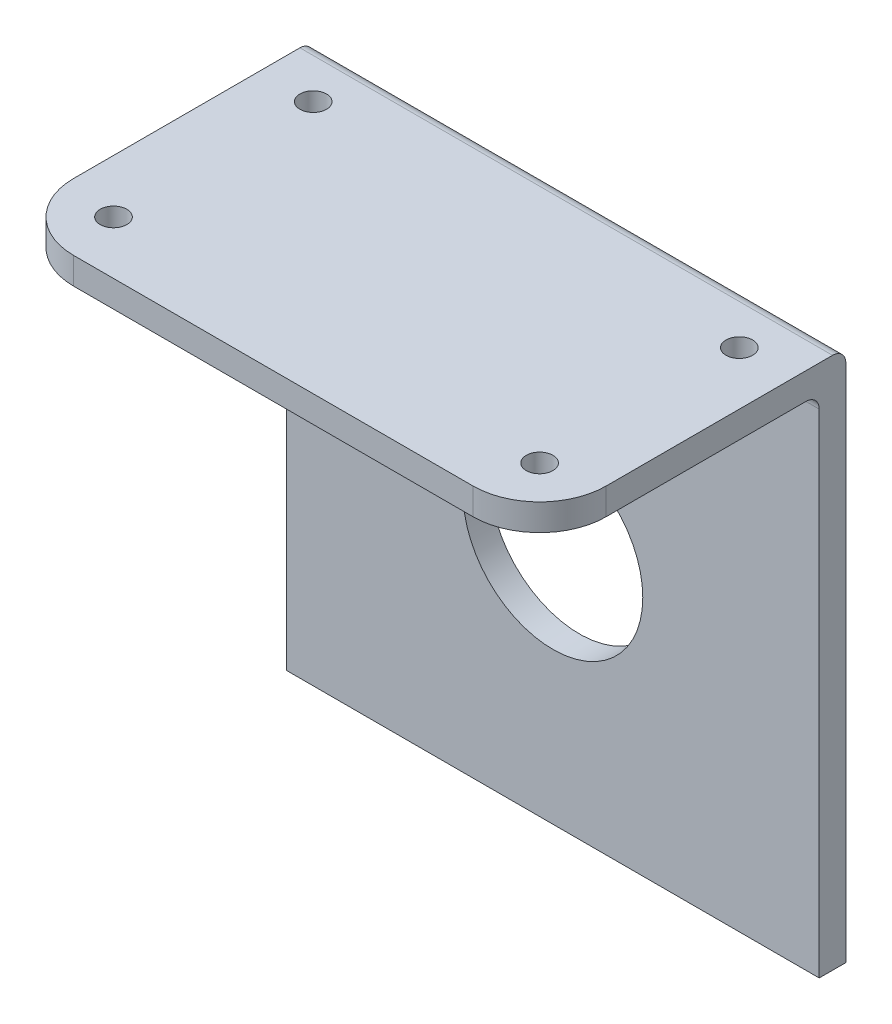
ISO-10303-21;
HEADER;
FILE_DESCRIPTION(('STEP AP214'),'2;1');
FILE_NAME('part.step','',(''),(''),'','','');
FILE_SCHEMA(('AUTOMOTIVE_DESIGN { 1 0 10303 214 1 1 1 1 }'));
ENDSEC;
DATA;
#1=APPLICATION_CONTEXT('core data for automotive mechanical design processes');
#2=APPLICATION_PROTOCOL_DEFINITION('international standard','automotive_design',2000,#1);
#3=PRODUCT_CONTEXT('',#1,'mechanical');
#4=PRODUCT('Part','Part','',(#3));
#5=PRODUCT_RELATED_PRODUCT_CATEGORY('part','',(#4));
#6=PRODUCT_DEFINITION_FORMATION('','',#4);
#7=PRODUCT_DEFINITION_CONTEXT('part definition',#1,'design');
#8=PRODUCT_DEFINITION('design','',#6,#7);
#9=PRODUCT_DEFINITION_SHAPE('','',#8);
#10=(LENGTH_UNIT() NAMED_UNIT(*) SI_UNIT(.MILLI.,.METRE.));
#11=(NAMED_UNIT(*) PLANE_ANGLE_UNIT() SI_UNIT($,.RADIAN.));
#12=(NAMED_UNIT(*) SI_UNIT($,.STERADIAN.) SOLID_ANGLE_UNIT());
#13=UNCERTAINTY_MEASURE_WITH_UNIT(LENGTH_MEASURE(1.E-05),#10,'distance_accuracy_value','');
#14=(GEOMETRIC_REPRESENTATION_CONTEXT(3) GLOBAL_UNCERTAINTY_ASSIGNED_CONTEXT((#13)) GLOBAL_UNIT_ASSIGNED_CONTEXT((#10,
#11,#12)) REPRESENTATION_CONTEXT('',''));
#15=CARTESIAN_POINT('',(0.,0.,0.));
#16=DIRECTION('',(0.,0.,1.));
#17=DIRECTION('',(1.,0.,0.));
#18=AXIS2_PLACEMENT_3D('',#15,#16,#17);
#19=CARTESIAN_POINT('',(0.,0.,2.));
#20=DIRECTION('',(0.,0.,1.));
#21=DIRECTION('',(1.,0.,0.));
#22=AXIS2_PLACEMENT_3D('',#19,#20,#21);
#23=PLANE('',#22);
#24=CARTESIAN_POINT('',(0.,-1.87885429106523,2.));
#25=DIRECTION('',(0.,0.,1.));
#26=DIRECTION('',(1.,0.,0.));
#27=AXIS2_PLACEMENT_3D('',#24,#25,#26);
#28=CIRCLE('',#27,6.75);
#29=CARTESIAN_POINT('',(6.75,-1.87885429106523,2.));
#30=VERTEX_POINT('',#29);
#31=EDGE_CURVE('E153',#30,#30,#28,.T.);
#32=ORIENTED_EDGE('',*,*,#31,.F.);
#33=EDGE_LOOP('',(#32));
#34=FACE_BOUND('',#33,.T.);
#35=DIRECTION('',(0.,1.,0.));
#36=VECTOR('',#35,1.);
#37=CARTESIAN_POINT('',(20.,20.,2.));
#38=LINE('',#37,#36);
#39=CARTESIAN_POINT('',(20.,-20.,2.));
#40=VERTEX_POINT('',#39);
#41=CARTESIAN_POINT('',(20.,17.,2.));
#42=VERTEX_POINT('',#41);
#43=EDGE_CURVE('E131',#40,#42,#38,.T.);
#44=ORIENTED_EDGE('',*,*,#43,.T.);
#45=DIRECTION('',(-1.,0.,0.));
#46=VECTOR('',#45,1.);
#47=CARTESIAN_POINT('',(0.,17.,2.));
#48=LINE('',#47,#46);
#49=CARTESIAN_POINT('',(-20.,17.,2.));
#50=VERTEX_POINT('',#49);
#51=EDGE_CURVE('E128',#42,#50,#48,.T.);
#52=ORIENTED_EDGE('',*,*,#51,.T.);
#53=DIRECTION('',(0.,-1.,0.));
#54=VECTOR('',#53,1.);
#55=CARTESIAN_POINT('',(-20.,20.,2.));
#56=LINE('',#55,#54);
#57=CARTESIAN_POINT('',(-20.,-20.,2.));
#58=VERTEX_POINT('',#57);
#59=EDGE_CURVE('E121',#50,#58,#56,.T.);
#60=ORIENTED_EDGE('',*,*,#59,.T.);
#61=DIRECTION('',(1.,0.,0.));
#62=VECTOR('',#61,1.);
#63=CARTESIAN_POINT('',(-20.,-20.,2.));
#64=LINE('',#63,#62);
#65=EDGE_CURVE('E125',#58,#40,#64,.T.);
#66=ORIENTED_EDGE('',*,*,#65,.T.);
#67=EDGE_LOOP('',(#44,#52,#60,#66));
#68=FACE_BOUND('',#67,.T.);
#69=ADVANCED_FACE('F38',(#34,#68),#23,.T.);
#70=CARTESIAN_POINT('',(0.,0.,0.));
#71=DIRECTION('',(0.,0.,1.));
#72=DIRECTION('',(1.,0.,0.));
#73=AXIS2_PLACEMENT_3D('',#70,#71,#72);
#74=PLANE('',#73);
#75=DIRECTION('',(0.,-1.,0.));
#76=VECTOR('',#75,1.);
#77=CARTESIAN_POINT('',(-20.,20.,0.));
#78=LINE('',#77,#76);
#79=CARTESIAN_POINT('',(-20.,19.,0.));
#80=VERTEX_POINT('',#79);
#81=CARTESIAN_POINT('',(-20.,-20.,0.));
#82=VERTEX_POINT('',#81);
#83=EDGE_CURVE('E137',#80,#82,#78,.T.);
#84=ORIENTED_EDGE('',*,*,#83,.F.);
#85=DIRECTION('',(-1.,0.,0.));
#86=VECTOR('',#85,1.);
#87=CARTESIAN_POINT('',(0.,19.,0.));
#88=LINE('',#87,#86);
#89=CARTESIAN_POINT('',(20.,19.,0.));
#90=VERTEX_POINT('',#89);
#91=EDGE_CURVE('E165',#80,#90,#88,.F.);
#92=ORIENTED_EDGE('',*,*,#91,.T.);
#93=DIRECTION('',(0.,1.,0.));
#94=VECTOR('',#93,1.);
#95=CARTESIAN_POINT('',(20.,20.,0.));
#96=LINE('',#95,#94);
#97=CARTESIAN_POINT('',(20.,-20.,0.));
#98=VERTEX_POINT('',#97);
#99=EDGE_CURVE('E150',#98,#90,#96,.T.);
#100=ORIENTED_EDGE('',*,*,#99,.F.);
#101=DIRECTION('',(1.,0.,0.));
#102=VECTOR('',#101,1.);
#103=CARTESIAN_POINT('',(-20.,-20.,0.));
#104=LINE('',#103,#102);
#105=EDGE_CURVE('E155',#82,#98,#104,.T.);
#106=ORIENTED_EDGE('',*,*,#105,.F.);
#107=EDGE_LOOP('',(#84,#92,#100,#106));
#108=FACE_BOUND('',#107,.T.);
#109=CARTESIAN_POINT('',(0.,-1.87885429106523,0.));
#110=DIRECTION('',(0.,0.,1.));
#111=DIRECTION('',(1.,0.,0.));
#112=AXIS2_PLACEMENT_3D('',#109,#110,#111);
#113=CIRCLE('',#112,6.75);
#114=CARTESIAN_POINT('',(6.75,-1.87885429106523,0.));
#115=VERTEX_POINT('',#114);
#116=EDGE_CURVE('E225',#115,#115,#113,.T.);
#117=ORIENTED_EDGE('',*,*,#116,.T.);
#118=EDGE_LOOP('',(#117));
#119=FACE_BOUND('',#118,.T.);
#120=ADVANCED_FACE('F286',(#108,#119),#74,.F.);
#121=CARTESIAN_POINT('',(20.,20.,2.));
#122=DIRECTION('',(-1.,0.,0.));
#123=DIRECTION('',(0.,-1.,0.));
#124=AXIS2_PLACEMENT_3D('',#121,#122,#123);
#125=PLANE('',#124);
#126=DIRECTION('',(0.,0.,-1.));
#127=VECTOR('',#126,1.);
#128=CARTESIAN_POINT('',(20.,20.,2.));
#129=LINE('',#128,#127);
#130=CARTESIAN_POINT('',(20.,20.,18.));
#131=VERTEX_POINT('',#130);
#132=CARTESIAN_POINT('',(20.,20.,1.));
#133=VERTEX_POINT('',#132);
#134=EDGE_CURVE('E158',#131,#133,#129,.T.);
#135=ORIENTED_EDGE('',*,*,#134,.F.);
#136=DIRECTION('',(0.,1.,0.));
#137=VECTOR('',#136,1.);
#138=CARTESIAN_POINT('',(20.,18.,18.));
#139=LINE('',#138,#137);
#140=CARTESIAN_POINT('',(20.,18.,18.));
#141=VERTEX_POINT('',#140);
#142=EDGE_CURVE('E61',#131,#141,#139,.F.);
#143=ORIENTED_EDGE('',*,*,#142,.T.);
#144=DIRECTION('',(0.,0.,-1.));
#145=VECTOR('',#144,1.);
#146=CARTESIAN_POINT('',(20.,18.,23.));
#147=LINE('',#146,#145);
#148=CARTESIAN_POINT('',(20.,18.,3.));
#149=VERTEX_POINT('',#148);
#150=EDGE_CURVE('E197',#141,#149,#147,.T.);
#151=ORIENTED_EDGE('',*,*,#150,.T.);
#152=CARTESIAN_POINT('',(20.,17.,3.));
#153=DIRECTION('',(-1.,0.,0.));
#154=DIRECTION('',(0.,-1.,0.));
#155=AXIS2_PLACEMENT_3D('',#152,#153,#154);
#156=CIRCLE('',#155,1.);
#157=EDGE_CURVE('E180',#149,#42,#156,.T.);
#158=ORIENTED_EDGE('',*,*,#157,.T.);
#159=ORIENTED_EDGE('',*,*,#43,.F.);
#160=DIRECTION('',(0.,0.,-1.));
#161=VECTOR('',#160,1.);
#162=CARTESIAN_POINT('',(20.,-20.,2.));
#163=LINE('',#162,#161);
#164=EDGE_CURVE('E141',#40,#98,#163,.T.);
#165=ORIENTED_EDGE('',*,*,#164,.T.);
#166=ORIENTED_EDGE('',*,*,#99,.T.);
#167=CARTESIAN_POINT('',(20.,19.,1.));
#168=DIRECTION('',(-1.,0.,0.));
#169=DIRECTION('',(0.,-1.,0.));
#170=AXIS2_PLACEMENT_3D('',#167,#168,#169);
#171=CIRCLE('',#170,1.);
#172=EDGE_CURVE('E167',#90,#133,#171,.F.);
#173=ORIENTED_EDGE('',*,*,#172,.T.);
#174=EDGE_LOOP('',(#135,#143,#151,#158,#159,#165,#166,#173));
#175=FACE_BOUND('',#174,.T.);
#176=ADVANCED_FACE('F211',(#175),#125,.F.);
#177=CARTESIAN_POINT('',(-20.,20.,2.));
#178=DIRECTION('',(0.,-1.,0.));
#179=DIRECTION('',(0.,0.,-1.));
#180=AXIS2_PLACEMENT_3D('',#177,#178,#179);
#181=PLANE('',#180);
#182=CARTESIAN_POINT('',(-16.,20.,19.));
#183=DIRECTION('',(0.,1.,0.));
#184=DIRECTION('',(0.,0.,-1.));
#185=AXIS2_PLACEMENT_3D('',#182,#183,#184);
#186=CIRCLE('',#185,1.);
#187=CARTESIAN_POINT('',(-16.,20.,18.));
#188=VERTEX_POINT('',#187);
#189=EDGE_CURVE('E253',#188,#188,#186,.T.);
#190=ORIENTED_EDGE('',*,*,#189,.F.);
#191=EDGE_LOOP('',(#190));
#192=FACE_BOUND('',#191,.T.);
#193=CARTESIAN_POINT('',(16.,20.,19.));
#194=DIRECTION('',(0.,1.,0.));
#195=DIRECTION('',(0.,0.,1.));
#196=AXIS2_PLACEMENT_3D('',#193,#194,#195);
#197=CIRCLE('',#196,1.);
#198=CARTESIAN_POINT('',(16.,20.,20.));
#199=VERTEX_POINT('',#198);
#200=EDGE_CURVE('E252',#199,#199,#197,.T.);
#201=ORIENTED_EDGE('',*,*,#200,.F.);
#202=EDGE_LOOP('',(#201));
#203=FACE_BOUND('',#202,.T.);
#204=CARTESIAN_POINT('',(16.,20.,4.));
#205=DIRECTION('',(0.,1.,0.));
#206=DIRECTION('',(0.,0.,-1.));
#207=AXIS2_PLACEMENT_3D('',#204,#205,#206);
#208=CIRCLE('',#207,1.);
#209=CARTESIAN_POINT('',(16.,20.,3.));
#210=VERTEX_POINT('',#209);
#211=EDGE_CURVE('E259',#210,#210,#208,.T.);
#212=ORIENTED_EDGE('',*,*,#211,.F.);
#213=EDGE_LOOP('',(#212));
#214=FACE_BOUND('',#213,.T.);
#215=CARTESIAN_POINT('',(-16.,20.,4.));
#216=DIRECTION('',(0.,1.,0.));
#217=DIRECTION('',(0.,0.,1.));
#218=AXIS2_PLACEMENT_3D('',#215,#216,#217);
#219=CIRCLE('',#218,1.);
#220=CARTESIAN_POINT('',(-16.,20.,5.));
#221=VERTEX_POINT('',#220);
#222=EDGE_CURVE('E243',#221,#221,#219,.T.);
#223=ORIENTED_EDGE('',*,*,#222,.F.);
#224=EDGE_LOOP('',(#223));
#225=FACE_BOUND('',#224,.T.);
#226=DIRECTION('',(-1.,0.,0.));
#227=VECTOR('',#226,1.);
#228=CARTESIAN_POINT('',(-20.,20.,23.));
#229=LINE('',#228,#227);
#230=CARTESIAN_POINT('',(15.,20.,23.));
#231=VERTEX_POINT('',#230);
#232=CARTESIAN_POINT('',(-15.,20.,23.));
#233=VERTEX_POINT('',#232);
#234=EDGE_CURVE('E205',#231,#233,#229,.T.);
#235=ORIENTED_EDGE('',*,*,#234,.F.);
#236=CARTESIAN_POINT('',(15.,20.,18.));
#237=DIRECTION('',(0.,-1.,0.));
#238=DIRECTION('',(0.,0.,-1.));
#239=AXIS2_PLACEMENT_3D('',#236,#237,#238);
#240=CIRCLE('',#239,5.);
#241=EDGE_CURVE('E190',#231,#131,#240,.F.);
#242=ORIENTED_EDGE('',*,*,#241,.T.);
#243=ORIENTED_EDGE('',*,*,#134,.T.);
#244=DIRECTION('',(-1.,0.,0.));
#245=VECTOR('',#244,1.);
#246=CARTESIAN_POINT('',(-20.,20.,1.));
#247=LINE('',#246,#245);
#248=CARTESIAN_POINT('',(-20.,20.,1.));
#249=VERTEX_POINT('',#248);
#250=EDGE_CURVE('E160',#133,#249,#247,.T.);
#251=ORIENTED_EDGE('',*,*,#250,.T.);
#252=DIRECTION('',(0.,0.,-1.));
#253=VECTOR('',#252,1.);
#254=CARTESIAN_POINT('',(-20.,20.,2.));
#255=LINE('',#254,#253);
#256=CARTESIAN_POINT('',(-20.,20.,18.));
#257=VERTEX_POINT('',#256);
#258=EDGE_CURVE('E140',#257,#249,#255,.T.);
#259=ORIENTED_EDGE('',*,*,#258,.F.);
#260=CARTESIAN_POINT('',(-15.,20.,18.));
#261=DIRECTION('',(0.,-1.,0.));
#262=DIRECTION('',(0.,0.,-1.));
#263=AXIS2_PLACEMENT_3D('',#260,#261,#262);
#264=CIRCLE('',#263,5.);
#265=EDGE_CURVE('E188',#257,#233,#264,.F.);
#266=ORIENTED_EDGE('',*,*,#265,.T.);
#267=EDGE_LOOP('',(#235,#242,#243,#251,#259,#266));
#268=FACE_BOUND('',#267,.T.);
#269=ADVANCED_FACE('F210',(#192,#203,#214,#225,#268),#181,.F.);
#270=CARTESIAN_POINT('',(-20.,20.,2.));
#271=DIRECTION('',(1.,0.,0.));
#272=DIRECTION('',(0.,1.,0.));
#273=AXIS2_PLACEMENT_3D('',#270,#271,#272);
#274=PLANE('',#273);
#275=DIRECTION('',(0.,0.,-1.));
#276=VECTOR('',#275,1.);
#277=CARTESIAN_POINT('',(-20.,18.,23.));
#278=LINE('',#277,#276);
#279=CARTESIAN_POINT('',(-20.,18.,18.));
#280=VERTEX_POINT('',#279);
#281=CARTESIAN_POINT('',(-20.,18.,3.));
#282=VERTEX_POINT('',#281);
#283=EDGE_CURVE('E223',#280,#282,#278,.T.);
#284=ORIENTED_EDGE('',*,*,#283,.F.);
#285=DIRECTION('',(0.,-1.,0.));
#286=VECTOR('',#285,1.);
#287=CARTESIAN_POINT('',(-20.,20.,18.));
#288=LINE('',#287,#286);
#289=EDGE_CURVE('E11',#280,#257,#288,.F.);
#290=ORIENTED_EDGE('',*,*,#289,.T.);
#291=ORIENTED_EDGE('',*,*,#258,.T.);
#292=CARTESIAN_POINT('',(-20.,19.,1.));
#293=DIRECTION('',(1.,0.,0.));
#294=DIRECTION('',(0.,1.,0.));
#295=AXIS2_PLACEMENT_3D('',#292,#293,#294);
#296=CIRCLE('',#295,1.);
#297=EDGE_CURVE('E163',#249,#80,#296,.F.);
#298=ORIENTED_EDGE('',*,*,#297,.T.);
#299=ORIENTED_EDGE('',*,*,#83,.T.);
#300=DIRECTION('',(0.,0.,-1.));
#301=VECTOR('',#300,1.);
#302=CARTESIAN_POINT('',(-20.,-20.,2.));
#303=LINE('',#302,#301);
#304=EDGE_CURVE('E134',#58,#82,#303,.T.);
#305=ORIENTED_EDGE('',*,*,#304,.F.);
#306=ORIENTED_EDGE('',*,*,#59,.F.);
#307=CARTESIAN_POINT('',(-20.,17.,3.));
#308=DIRECTION('',(1.,0.,0.));
#309=DIRECTION('',(0.,1.,0.));
#310=AXIS2_PLACEMENT_3D('',#307,#308,#309);
#311=CIRCLE('',#310,1.);
#312=EDGE_CURVE('E178',#50,#282,#311,.T.);
#313=ORIENTED_EDGE('',*,*,#312,.T.);
#314=EDGE_LOOP('',(#284,#290,#291,#298,#299,#305,#306,#313));
#315=FACE_BOUND('',#314,.T.);
#316=ADVANCED_FACE('F135',(#315),#274,.F.);
#317=CARTESIAN_POINT('',(-20.,-20.,2.));
#318=DIRECTION('',(0.,1.,0.));
#319=DIRECTION('',(0.,0.,1.));
#320=AXIS2_PLACEMENT_3D('',#317,#318,#319);
#321=PLANE('',#320);
#322=ORIENTED_EDGE('',*,*,#105,.T.);
#323=ORIENTED_EDGE('',*,*,#164,.F.);
#324=ORIENTED_EDGE('',*,*,#65,.F.);
#325=ORIENTED_EDGE('',*,*,#304,.T.);
#326=EDGE_LOOP('',(#322,#323,#324,#325));
#327=FACE_BOUND('',#326,.T.);
#328=ADVANCED_FACE('F143',(#327),#321,.F.);
#329=CARTESIAN_POINT('',(0.,-1.87885429106523,2.));
#330=DIRECTION('',(0.,0.,-1.));
#331=DIRECTION('',(-1.,0.,0.));
#332=AXIS2_PLACEMENT_3D('',#329,#330,#331);
#333=CYLINDRICAL_SURFACE('',#332,6.75);
#334=ORIENTED_EDGE('',*,*,#31,.T.);
#335=EDGE_LOOP('',(#334));
#336=FACE_BOUND('',#335,.T.);
#337=ORIENTED_EDGE('',*,*,#116,.F.);
#338=EDGE_LOOP('',(#337));
#339=FACE_BOUND('',#338,.T.);
#340=ADVANCED_FACE('F296',(#336,#339),#333,.F.);
#341=CARTESIAN_POINT('',(-20.,18.,23.));
#342=DIRECTION('',(0.,1.,0.));
#343=DIRECTION('',(0.,0.,1.));
#344=AXIS2_PLACEMENT_3D('',#341,#342,#343);
#345=PLANE('',#344);
#346=CARTESIAN_POINT('',(-16.,18.,19.));
#347=DIRECTION('',(0.,1.,0.));
#348=DIRECTION('',(0.,0.,1.));
#349=AXIS2_PLACEMENT_3D('',#346,#347,#348);
#350=CIRCLE('',#349,1.);
#351=CARTESIAN_POINT('',(-16.,18.,20.));
#352=VERTEX_POINT('',#351);
#353=EDGE_CURVE('E249',#352,#352,#350,.F.);
#354=ORIENTED_EDGE('',*,*,#353,.F.);
#355=EDGE_LOOP('',(#354));
#356=FACE_BOUND('',#355,.T.);
#357=CARTESIAN_POINT('',(16.,18.,19.));
#358=DIRECTION('',(0.,1.,0.));
#359=DIRECTION('',(0.,0.,1.));
#360=AXIS2_PLACEMENT_3D('',#357,#358,#359);
#361=CIRCLE('',#360,1.);
#362=CARTESIAN_POINT('',(16.,18.,20.));
#363=VERTEX_POINT('',#362);
#364=EDGE_CURVE('E256',#363,#363,#361,.F.);
#365=ORIENTED_EDGE('',*,*,#364,.F.);
#366=EDGE_LOOP('',(#365));
#367=FACE_BOUND('',#366,.T.);
#368=ORIENTED_EDGE('',*,*,#150,.F.);
#369=CARTESIAN_POINT('',(15.,18.,18.));
#370=DIRECTION('',(0.,1.,0.));
#371=DIRECTION('',(0.,0.,1.));
#372=AXIS2_PLACEMENT_3D('',#369,#370,#371);
#373=CIRCLE('',#372,5.);
#374=CARTESIAN_POINT('',(15.,18.,23.));
#375=VERTEX_POINT('',#374);
#376=EDGE_CURVE('E46',#141,#375,#373,.F.);
#377=ORIENTED_EDGE('',*,*,#376,.T.);
#378=DIRECTION('',(1.,0.,0.));
#379=VECTOR('',#378,1.);
#380=CARTESIAN_POINT('',(-20.,18.,23.));
#381=LINE('',#380,#379);
#382=CARTESIAN_POINT('',(-15.,18.,23.));
#383=VERTEX_POINT('',#382);
#384=EDGE_CURVE('E196',#383,#375,#381,.T.);
#385=ORIENTED_EDGE('',*,*,#384,.F.);
#386=CARTESIAN_POINT('',(-15.,18.,18.));
#387=DIRECTION('',(0.,1.,0.));
#388=DIRECTION('',(0.,0.,1.));
#389=AXIS2_PLACEMENT_3D('',#386,#387,#388);
#390=CIRCLE('',#389,5.);
#391=EDGE_CURVE('E53',#383,#280,#390,.F.);
#392=ORIENTED_EDGE('',*,*,#391,.T.);
#393=ORIENTED_EDGE('',*,*,#283,.T.);
#394=DIRECTION('',(-1.,0.,0.));
#395=VECTOR('',#394,1.);
#396=CARTESIAN_POINT('',(-20.,18.,3.));
#397=LINE('',#396,#395);
#398=CARTESIAN_POINT('',(-16.,18.,3.));
#399=VERTEX_POINT('',#398);
#400=EDGE_CURVE('E176',#282,#399,#397,.F.);
#401=ORIENTED_EDGE('',*,*,#400,.T.);
#402=CARTESIAN_POINT('',(-16.,18.,4.));
#403=DIRECTION('',(0.,1.,0.));
#404=DIRECTION('',(0.,0.,1.));
#405=AXIS2_PLACEMENT_3D('',#402,#403,#404);
#406=CIRCLE('',#405,1.);
#407=EDGE_CURVE('E206',#399,#399,#406,.F.);
#408=ORIENTED_EDGE('',*,*,#407,.F.);
#409=DIRECTION('',(-1.,0.,0.));
#410=VECTOR('',#409,1.);
#411=CARTESIAN_POINT('',(-20.,18.,3.));
#412=LINE('',#411,#410);
#413=CARTESIAN_POINT('',(16.,18.,3.));
#414=VERTEX_POINT('',#413);
#415=EDGE_CURVE('E174',#399,#414,#412,.F.);
#416=ORIENTED_EDGE('',*,*,#415,.T.);
#417=CARTESIAN_POINT('',(16.,18.,4.));
#418=DIRECTION('',(0.,1.,0.));
#419=DIRECTION('',(0.,0.,1.));
#420=AXIS2_PLACEMENT_3D('',#417,#418,#419);
#421=CIRCLE('',#420,1.);
#422=EDGE_CURVE('E246',#414,#414,#421,.F.);
#423=ORIENTED_EDGE('',*,*,#422,.F.);
#424=DIRECTION('',(-1.,0.,0.));
#425=VECTOR('',#424,1.);
#426=CARTESIAN_POINT('',(-20.,18.,3.));
#427=LINE('',#426,#425);
#428=EDGE_CURVE('E171',#414,#149,#427,.F.);
#429=ORIENTED_EDGE('',*,*,#428,.T.);
#430=EDGE_LOOP('',(#368,#377,#385,#392,#393,#401,#408,#416,#423,#429));
#431=FACE_BOUND('',#430,.T.);
#432=ADVANCED_FACE('F195',(#356,#367,#431),#345,.F.);
#433=CARTESIAN_POINT('',(0.,0.,23.));
#434=DIRECTION('',(0.,0.,1.));
#435=DIRECTION('',(1.,0.,0.));
#436=AXIS2_PLACEMENT_3D('',#433,#434,#435);
#437=PLANE('',#436);
#438=ORIENTED_EDGE('',*,*,#384,.T.);
#439=DIRECTION('',(0.,1.,0.));
#440=VECTOR('',#439,1.);
#441=CARTESIAN_POINT('',(15.,20.,23.));
#442=LINE('',#441,#440);
#443=EDGE_CURVE('E185',#375,#231,#442,.T.);
#444=ORIENTED_EDGE('',*,*,#443,.T.);
#445=ORIENTED_EDGE('',*,*,#234,.T.);
#446=DIRECTION('',(0.,-1.,0.));
#447=VECTOR('',#446,1.);
#448=CARTESIAN_POINT('',(-15.,18.,23.));
#449=LINE('',#448,#447);
#450=EDGE_CURVE('E182',#233,#383,#449,.T.);
#451=ORIENTED_EDGE('',*,*,#450,.T.);
#452=EDGE_LOOP('',(#438,#444,#445,#451));
#453=FACE_BOUND('',#452,.T.);
#454=ADVANCED_FACE('F201',(#453),#437,.T.);
#455=CARTESIAN_POINT('',(-16.,15.1715728752538,4.));
#456=DIRECTION('',(0.,1.,0.));
#457=DIRECTION('',(0.,0.,1.));
#458=AXIS2_PLACEMENT_3D('',#455,#456,#457);
#459=CYLINDRICAL_SURFACE('',#458,1.);
#460=ORIENTED_EDGE('',*,*,#407,.T.);
#461=EDGE_LOOP('',(#460));
#462=FACE_BOUND('',#461,.T.);
#463=ORIENTED_EDGE('',*,*,#222,.T.);
#464=EDGE_LOOP('',(#463));
#465=FACE_BOUND('',#464,.T.);
#466=ADVANCED_FACE('F241',(#462,#465),#459,.F.);
#467=CARTESIAN_POINT('',(16.,15.1715728752538,4.));
#468=DIRECTION('',(0.,1.,0.));
#469=DIRECTION('',(0.,0.,1.));
#470=AXIS2_PLACEMENT_3D('',#467,#468,#469);
#471=CYLINDRICAL_SURFACE('',#470,1.);
#472=ORIENTED_EDGE('',*,*,#422,.T.);
#473=EDGE_LOOP('',(#472));
#474=FACE_BOUND('',#473,.T.);
#475=ORIENTED_EDGE('',*,*,#211,.T.);
#476=EDGE_LOOP('',(#475));
#477=FACE_BOUND('',#476,.T.);
#478=ADVANCED_FACE('F267',(#474,#477),#471,.F.);
#479=CARTESIAN_POINT('',(16.,15.1715728752538,19.));
#480=DIRECTION('',(0.,1.,0.));
#481=DIRECTION('',(0.,0.,1.));
#482=AXIS2_PLACEMENT_3D('',#479,#480,#481);
#483=CYLINDRICAL_SURFACE('',#482,1.);
#484=ORIENTED_EDGE('',*,*,#364,.T.);
#485=EDGE_LOOP('',(#484));
#486=FACE_BOUND('',#485,.T.);
#487=ORIENTED_EDGE('',*,*,#200,.T.);
#488=EDGE_LOOP('',(#487));
#489=FACE_BOUND('',#488,.T.);
#490=ADVANCED_FACE('F280',(#486,#489),#483,.F.);
#491=CARTESIAN_POINT('',(-16.,15.1715728752538,19.));
#492=DIRECTION('',(0.,1.,0.));
#493=DIRECTION('',(0.,0.,1.));
#494=AXIS2_PLACEMENT_3D('',#491,#492,#493);
#495=CYLINDRICAL_SURFACE('',#494,1.);
#496=ORIENTED_EDGE('',*,*,#353,.T.);
#497=EDGE_LOOP('',(#496));
#498=FACE_BOUND('',#497,.T.);
#499=ORIENTED_EDGE('',*,*,#189,.T.);
#500=EDGE_LOOP('',(#499));
#501=FACE_BOUND('',#500,.T.);
#502=ADVANCED_FACE('F307',(#498,#501),#495,.F.);
#503=CARTESIAN_POINT('',(-20.,19.,1.));
#504=DIRECTION('',(-1.,0.,0.));
#505=DIRECTION('',(0.,0.,1.));
#506=AXIS2_PLACEMENT_3D('',#503,#504,#505);
#507=CYLINDRICAL_SURFACE('',#506,1.);
#508=ORIENTED_EDGE('',*,*,#172,.F.);
#509=ORIENTED_EDGE('',*,*,#91,.F.);
#510=ORIENTED_EDGE('',*,*,#297,.F.);
#511=ORIENTED_EDGE('',*,*,#250,.F.);
#512=EDGE_LOOP('',(#508,#509,#510,#511));
#513=FACE_BOUND('',#512,.T.);
#514=ADVANCED_FACE('F218',(#513),#507,.T.);
#515=CARTESIAN_POINT('',(0.,17.,3.));
#516=DIRECTION('',(-1.,0.,0.));
#517=DIRECTION('',(0.,0.,1.));
#518=AXIS2_PLACEMENT_3D('',#515,#516,#517);
#519=CYLINDRICAL_SURFACE('',#518,1.);
#520=ORIENTED_EDGE('',*,*,#415,.F.);
#521=ORIENTED_EDGE('',*,*,#400,.F.);
#522=ORIENTED_EDGE('',*,*,#312,.F.);
#523=ORIENTED_EDGE('',*,*,#51,.F.);
#524=ORIENTED_EDGE('',*,*,#157,.F.);
#525=ORIENTED_EDGE('',*,*,#428,.F.);
#526=EDGE_LOOP('',(#520,#521,#522,#523,#524,#525));
#527=FACE_BOUND('',#526,.T.);
#528=ADVANCED_FACE('F236',(#527),#519,.F.);
#529=CARTESIAN_POINT('',(15.,0.,18.));
#530=DIRECTION('',(0.,-1.,0.));
#531=DIRECTION('',(1.,0.,0.));
#532=AXIS2_PLACEMENT_3D('',#529,#530,#531);
#533=CYLINDRICAL_SURFACE('',#532,5.);
#534=ORIENTED_EDGE('',*,*,#376,.F.);
#535=ORIENTED_EDGE('',*,*,#142,.F.);
#536=ORIENTED_EDGE('',*,*,#241,.F.);
#537=ORIENTED_EDGE('',*,*,#443,.F.);
#538=EDGE_LOOP('',(#534,#535,#536,#537));
#539=FACE_BOUND('',#538,.T.);
#540=ADVANCED_FACE('F208',(#539),#533,.T.);
#541=CARTESIAN_POINT('',(-15.,0.,18.));
#542=DIRECTION('',(0.,1.,0.));
#543=DIRECTION('',(-1.,0.,0.));
#544=AXIS2_PLACEMENT_3D('',#541,#542,#543);
#545=CYLINDRICAL_SURFACE('',#544,5.);
#546=ORIENTED_EDGE('',*,*,#265,.F.);
#547=ORIENTED_EDGE('',*,*,#289,.F.);
#548=ORIENTED_EDGE('',*,*,#391,.F.);
#549=ORIENTED_EDGE('',*,*,#450,.F.);
#550=EDGE_LOOP('',(#546,#547,#548,#549));
#551=FACE_BOUND('',#550,.T.);
#552=ADVANCED_FACE('F40',(#551),#545,.T.);
#553=CLOSED_SHELL('',(#69,#120,#176,#269,#316,#328,#340,#432,#454,#466,#478,#490,#502,#514,#528,
#540,#552));
#554=MANIFOLD_SOLID_BREP('B2',#553);
#555=ADVANCED_BREP_SHAPE_REPRESENTATION('',(#18,#554),#14);
#556=SHAPE_DEFINITION_REPRESENTATION(#9,#555);
ENDSEC;
END-ISO-10303-21;
